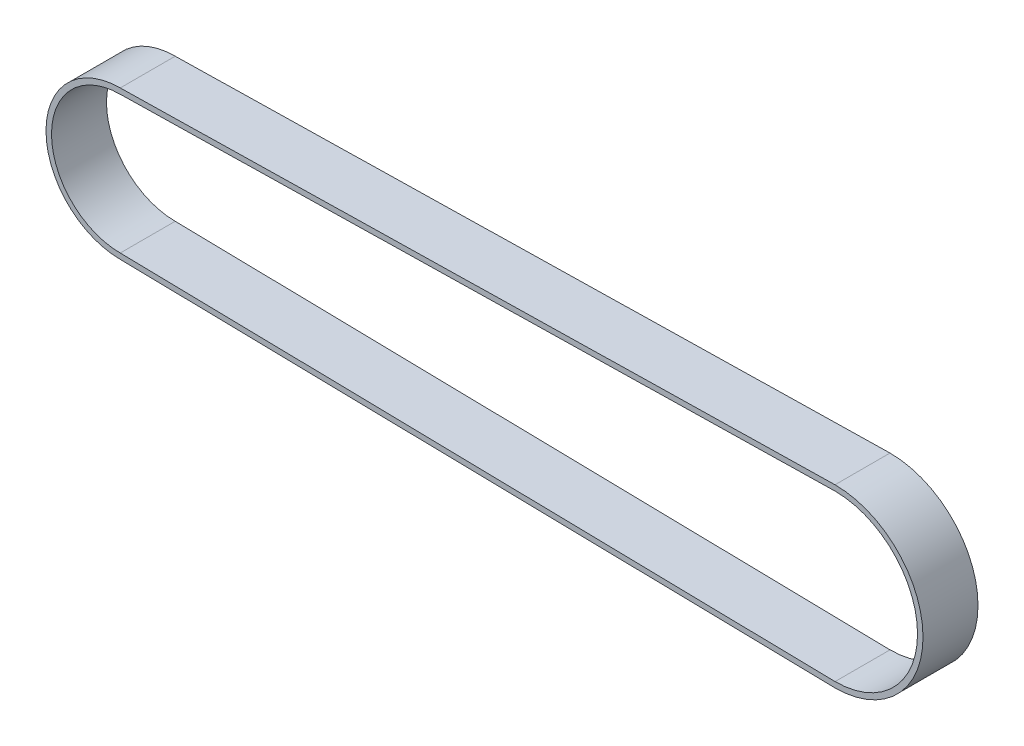
ISO-10303-21;
HEADER;
FILE_DESCRIPTION(('STEP AP214'),'2;1');
FILE_NAME('part.step','',(''),(''),'','','');
FILE_SCHEMA(('AUTOMOTIVE_DESIGN { 1 0 10303 214 1 1 1 1 }'));
ENDSEC;
DATA;
#1=APPLICATION_CONTEXT('core data for automotive mechanical design processes');
#2=APPLICATION_PROTOCOL_DEFINITION('international standard','automotive_design',2000,#1);
#3=PRODUCT_CONTEXT('',#1,'mechanical');
#4=PRODUCT('Part','Part','',(#3));
#5=PRODUCT_RELATED_PRODUCT_CATEGORY('part','',(#4));
#6=PRODUCT_DEFINITION_FORMATION('','',#4);
#7=PRODUCT_DEFINITION_CONTEXT('part definition',#1,'design');
#8=PRODUCT_DEFINITION('design','',#6,#7);
#9=PRODUCT_DEFINITION_SHAPE('','',#8);
#10=(LENGTH_UNIT() NAMED_UNIT(*) SI_UNIT(.MILLI.,.METRE.));
#11=(NAMED_UNIT(*) PLANE_ANGLE_UNIT() SI_UNIT($,.RADIAN.));
#12=(NAMED_UNIT(*) SI_UNIT($,.STERADIAN.) SOLID_ANGLE_UNIT());
#13=UNCERTAINTY_MEASURE_WITH_UNIT(LENGTH_MEASURE(1.E-05),#10,'distance_accuracy_value','');
#14=(GEOMETRIC_REPRESENTATION_CONTEXT(3) GLOBAL_UNCERTAINTY_ASSIGNED_CONTEXT((#13)) GLOBAL_UNIT_ASSIGNED_CONTEXT((#10,
#11,#12)) REPRESENTATION_CONTEXT('',''));
#15=CARTESIAN_POINT('',(0.,0.,0.));
#16=DIRECTION('',(0.,0.,1.));
#17=DIRECTION('',(1.,0.,0.));
#18=AXIS2_PLACEMENT_3D('',#15,#16,#17);
#19=CARTESIAN_POINT('',(-0.2202138454263,11.4511199621676,10.));
#20=DIRECTION('',(-0.0192272142313432,0.999815140029847,0.));
#21=DIRECTION('',(-0.999815140029847,-0.0192272142313432,0.));
#22=AXIS2_PLACEMENT_3D('',#19,#20,#21);
#23=PLANE('',#22);
#24=DIRECTION('',(0.999815140029847,0.0192272142313432,0.));
#25=VECTOR('',#24,1.);
#26=CARTESIAN_POINT('',(-0.2202138454263,11.4511199621676,0.));
#27=LINE('',#26,#25);
#28=CARTESIAN_POINT('',(-63.3751394755015,10.2366021615892,0.));
#29=VERTEX_POINT('',#28);
#30=CARTESIAN_POINT('',(66.6248605244986,12.7366021615892,0.));
#31=VERTEX_POINT('',#30);
#32=EDGE_CURVE('E140',#29,#31,#27,.T.);
#33=ORIENTED_EDGE('',*,*,#32,.T.);
#34=DIRECTION('',(0.,0.,-1.));
#35=VECTOR('',#34,1.);
#36=CARTESIAN_POINT('',(66.6248605244986,12.7366021615892,10.));
#37=LINE('',#36,#35);
#38=CARTESIAN_POINT('',(66.6248605244986,12.7366021615892,10.));
#39=VERTEX_POINT('',#38);
#40=EDGE_CURVE('E11',#39,#31,#37,.T.);
#41=ORIENTED_EDGE('',*,*,#40,.F.);
#42=DIRECTION('',(0.999815140029847,0.0192272142313432,0.));
#43=VECTOR('',#42,1.);
#44=CARTESIAN_POINT('',(-0.2202138454263,11.4511199621676,10.));
#45=LINE('',#44,#43);
#46=CARTESIAN_POINT('',(-63.3751394755015,10.2366021615892,10.));
#47=VERTEX_POINT('',#46);
#48=EDGE_CURVE('E114',#47,#39,#45,.T.);
#49=ORIENTED_EDGE('',*,*,#48,.F.);
#50=DIRECTION('',(0.,0.,-1.));
#51=VECTOR('',#50,1.);
#52=CARTESIAN_POINT('',(-63.3751394755015,10.2366021615892,10.));
#53=LINE('',#52,#51);
#54=EDGE_CURVE('E147',#47,#29,#53,.T.);
#55=ORIENTED_EDGE('',*,*,#54,.T.);
#56=EDGE_LOOP('',(#33,#41,#49,#55));
#57=FACE_BOUND('',#56,.T.);
#58=ADVANCED_FACE('F33',(#57),#23,.F.);
#59=CARTESIAN_POINT('',(66.6248605244986,-2.26339783841076,10.));
#60=DIRECTION('',(0.,0.,-1.));
#61=DIRECTION('',(-1.,0.,0.));
#62=AXIS2_PLACEMENT_3D('',#59,#60,#61);
#63=CYLINDRICAL_SURFACE('',#62,15.);
#64=CARTESIAN_POINT('',(66.6248605244986,-2.26339783841076,0.));
#65=DIRECTION('',(0.,0.,1.));
#66=DIRECTION('',(1.,0.,0.));
#67=AXIS2_PLACEMENT_3D('',#64,#65,#66);
#68=CIRCLE('',#67,15.);
#69=CARTESIAN_POINT('',(66.6248605244986,-17.2633978384108,0.));
#70=VERTEX_POINT('',#69);
#71=EDGE_CURVE('E119',#31,#70,#68,.F.);
#72=ORIENTED_EDGE('',*,*,#71,.T.);
#73=DIRECTION('',(0.,0.,-1.));
#74=VECTOR('',#73,1.);
#75=CARTESIAN_POINT('',(66.6248605244986,-17.2633978384108,10.));
#76=LINE('',#75,#74);
#77=CARTESIAN_POINT('',(66.6248605244986,-17.2633978384108,10.));
#78=VERTEX_POINT('',#77);
#79=EDGE_CURVE('E43',#78,#70,#76,.T.);
#80=ORIENTED_EDGE('',*,*,#79,.F.);
#81=CARTESIAN_POINT('',(66.6248605244986,-2.26339783841076,10.));
#82=DIRECTION('',(0.,0.,1.));
#83=DIRECTION('',(1.,0.,0.));
#84=AXIS2_PLACEMENT_3D('',#81,#82,#83);
#85=CIRCLE('',#84,15.);
#86=EDGE_CURVE('E108',#39,#78,#85,.F.);
#87=ORIENTED_EDGE('',*,*,#86,.F.);
#88=ORIENTED_EDGE('',*,*,#40,.T.);
#89=EDGE_LOOP('',(#72,#80,#87,#88));
#90=FACE_BOUND('',#89,.T.);
#91=ADVANCED_FACE('F118',(#90),#63,.F.);
#92=CARTESIAN_POINT('',(-0.307235425904939,-15.9762421470568,10.));
#93=DIRECTION('',(-0.0192272142313432,-0.999815140029847,0.));
#94=DIRECTION('',(0.999815140029847,-0.0192272142313432,0.));
#95=AXIS2_PLACEMENT_3D('',#92,#93,#94);
#96=PLANE('',#95);
#97=DIRECTION('',(-0.999815140029847,0.0192272142313432,0.));
#98=VECTOR('',#97,1.);
#99=CARTESIAN_POINT('',(-0.307235425904939,-15.9762421470568,0.));
#100=LINE('',#99,#98);
#101=CARTESIAN_POINT('',(-63.3751394755014,-14.7633978384108,0.));
#102=VERTEX_POINT('',#101);
#103=EDGE_CURVE('E81',#70,#102,#100,.T.);
#104=ORIENTED_EDGE('',*,*,#103,.T.);
#105=DIRECTION('',(0.,0.,-1.));
#106=VECTOR('',#105,1.);
#107=CARTESIAN_POINT('',(-63.3751394755014,-14.7633978384108,10.));
#108=LINE('',#107,#106);
#109=CARTESIAN_POINT('',(-63.3751394755014,-14.7633978384108,10.));
#110=VERTEX_POINT('',#109);
#111=EDGE_CURVE('E120',#110,#102,#108,.T.);
#112=ORIENTED_EDGE('',*,*,#111,.F.);
#113=DIRECTION('',(-0.999815140029847,0.0192272142313432,0.));
#114=VECTOR('',#113,1.);
#115=CARTESIAN_POINT('',(-0.307235425904939,-15.9762421470568,10.));
#116=LINE('',#115,#114);
#117=EDGE_CURVE('E112',#78,#110,#116,.T.);
#118=ORIENTED_EDGE('',*,*,#117,.F.);
#119=ORIENTED_EDGE('',*,*,#79,.T.);
#120=EDGE_LOOP('',(#104,#112,#118,#119));
#121=FACE_BOUND('',#120,.T.);
#122=ADVANCED_FACE('F122',(#121),#96,.F.);
#123=CARTESIAN_POINT('',(66.6248605244986,-2.26339783841076,10.));
#124=DIRECTION('',(0.,0.,-1.));
#125=DIRECTION('',(-1.,0.,0.));
#126=AXIS2_PLACEMENT_3D('',#123,#124,#125);
#127=CYLINDRICAL_SURFACE('',#126,16.);
#128=CARTESIAN_POINT('',(66.6248605244986,-2.26339783841076,0.));
#129=DIRECTION('',(0.,0.,1.));
#130=DIRECTION('',(1.,0.,0.));
#131=AXIS2_PLACEMENT_3D('',#128,#129,#130);
#132=CIRCLE('',#131,16.);
#133=CARTESIAN_POINT('',(66.6248605244986,13.7366021615892,0.));
#134=VERTEX_POINT('',#133);
#135=CARTESIAN_POINT('',(66.6248605244986,-18.2633978384108,0.));
#136=VERTEX_POINT('',#135);
#137=EDGE_CURVE('E128',#134,#136,#132,.F.);
#138=ORIENTED_EDGE('',*,*,#137,.F.);
#139=DIRECTION('',(0.,0.,-1.));
#140=VECTOR('',#139,1.);
#141=CARTESIAN_POINT('',(66.6248605244986,13.7366021615892,10.));
#142=LINE('',#141,#140);
#143=CARTESIAN_POINT('',(66.6248605244986,13.7366021615892,10.));
#144=VERTEX_POINT('',#143);
#145=EDGE_CURVE('E37',#144,#134,#142,.T.);
#146=ORIENTED_EDGE('',*,*,#145,.F.);
#147=CARTESIAN_POINT('',(66.6248605244986,-2.26339783841076,10.));
#148=DIRECTION('',(0.,0.,1.));
#149=DIRECTION('',(1.,0.,0.));
#150=AXIS2_PLACEMENT_3D('',#147,#148,#149);
#151=CIRCLE('',#150,16.);
#152=CARTESIAN_POINT('',(66.6248605244986,-18.2633978384108,10.));
#153=VERTEX_POINT('',#152);
#154=EDGE_CURVE('E146',#144,#153,#151,.F.);
#155=ORIENTED_EDGE('',*,*,#154,.T.);
#156=DIRECTION('',(0.,0.,-1.));
#157=VECTOR('',#156,1.);
#158=CARTESIAN_POINT('',(66.6248605244986,-18.2633978384108,10.));
#159=LINE('',#158,#157);
#160=EDGE_CURVE('E124',#153,#136,#159,.T.);
#161=ORIENTED_EDGE('',*,*,#160,.T.);
#162=EDGE_LOOP('',(#138,#146,#155,#161));
#163=FACE_BOUND('',#162,.T.);
#164=ADVANCED_FACE('F35',(#163),#127,.T.);
#165=CARTESIAN_POINT('',(-0.239437505315394,12.4507502764005,10.));
#166=DIRECTION('',(-0.0192272142313432,0.999815140029847,0.));
#167=DIRECTION('',(-0.999815140029847,-0.0192272142313432,0.));
#168=AXIS2_PLACEMENT_3D('',#165,#166,#167);
#169=PLANE('',#168);
#170=DIRECTION('',(0.999815140029847,0.0192272142313432,0.));
#171=VECTOR('',#170,1.);
#172=CARTESIAN_POINT('',(-0.239437505315394,12.4507502764005,0.));
#173=LINE('',#172,#171);
#174=CARTESIAN_POINT('',(-63.3751394755015,11.2366021615892,0.));
#175=VERTEX_POINT('',#174);
#176=EDGE_CURVE('E131',#175,#134,#173,.T.);
#177=ORIENTED_EDGE('',*,*,#176,.F.);
#178=DIRECTION('',(0.,0.,-1.));
#179=VECTOR('',#178,1.);
#180=CARTESIAN_POINT('',(-63.3751394755015,11.2366021615892,10.));
#181=LINE('',#180,#179);
#182=CARTESIAN_POINT('',(-63.3751394755015,11.2366021615892,10.));
#183=VERTEX_POINT('',#182);
#184=EDGE_CURVE('E152',#183,#175,#181,.T.);
#185=ORIENTED_EDGE('',*,*,#184,.F.);
#186=DIRECTION('',(0.999815140029847,0.0192272142313432,0.));
#187=VECTOR('',#186,1.);
#188=CARTESIAN_POINT('',(-0.239437505315394,12.4507502764005,10.));
#189=LINE('',#188,#187);
#190=EDGE_CURVE('E161',#183,#144,#189,.T.);
#191=ORIENTED_EDGE('',*,*,#190,.T.);
#192=ORIENTED_EDGE('',*,*,#145,.T.);
#193=EDGE_LOOP('',(#177,#185,#191,#192));
#194=FACE_BOUND('',#193,.T.);
#195=ADVANCED_FACE('F159',(#194),#169,.T.);
#196=CARTESIAN_POINT('',(-63.3751394755014,-2.26339783841076,10.));
#197=DIRECTION('',(0.,0.,-1.));
#198=DIRECTION('',(-1.,0.,0.));
#199=AXIS2_PLACEMENT_3D('',#196,#197,#198);
#200=CYLINDRICAL_SURFACE('',#199,13.5);
#201=CARTESIAN_POINT('',(-63.3751394755014,-2.26339783841076,0.));
#202=DIRECTION('',(0.,0.,1.));
#203=DIRECTION('',(1.,0.,0.));
#204=AXIS2_PLACEMENT_3D('',#201,#202,#203);
#205=CIRCLE('',#204,13.5);
#206=CARTESIAN_POINT('',(-63.3751394755014,-15.7633978384108,0.));
#207=VERTEX_POINT('',#206);
#208=EDGE_CURVE('E134',#175,#207,#205,.T.);
#209=ORIENTED_EDGE('',*,*,#208,.T.);
#210=DIRECTION('',(0.,0.,-1.));
#211=VECTOR('',#210,1.);
#212=CARTESIAN_POINT('',(-63.3751394755014,-15.7633978384108,10.));
#213=LINE('',#212,#211);
#214=CARTESIAN_POINT('',(-63.3751394755014,-15.7633978384108,10.));
#215=VERTEX_POINT('',#214);
#216=EDGE_CURVE('E151',#215,#207,#213,.T.);
#217=ORIENTED_EDGE('',*,*,#216,.F.);
#218=CARTESIAN_POINT('',(-63.3751394755014,-2.26339783841076,10.));
#219=DIRECTION('',(0.,0.,1.));
#220=DIRECTION('',(1.,0.,0.));
#221=AXIS2_PLACEMENT_3D('',#218,#219,#220);
#222=CIRCLE('',#221,13.5);
#223=EDGE_CURVE('E169',#183,#215,#222,.T.);
#224=ORIENTED_EDGE('',*,*,#223,.F.);
#225=ORIENTED_EDGE('',*,*,#184,.T.);
#226=EDGE_LOOP('',(#209,#217,#224,#225));
#227=FACE_BOUND('',#226,.T.);
#228=ADVANCED_FACE('F167',(#227),#200,.T.);
#229=CARTESIAN_POINT('',(-0.326459085794033,-16.9758724612897,10.));
#230=DIRECTION('',(-0.0192272142313432,-0.999815140029847,0.));
#231=DIRECTION('',(0.999815140029847,-0.0192272142313432,0.));
#232=AXIS2_PLACEMENT_3D('',#229,#230,#231);
#233=PLANE('',#232);
#234=DIRECTION('',(-0.999815140029847,0.0192272142313432,0.));
#235=VECTOR('',#234,1.);
#236=CARTESIAN_POINT('',(-0.326459085794033,-16.9758724612897,0.));
#237=LINE('',#236,#235);
#238=EDGE_CURVE('E137',#136,#207,#237,.T.);
#239=ORIENTED_EDGE('',*,*,#238,.F.);
#240=ORIENTED_EDGE('',*,*,#160,.F.);
#241=DIRECTION('',(-0.999815140029847,0.0192272142313432,0.));
#242=VECTOR('',#241,1.);
#243=CARTESIAN_POINT('',(-0.326459085794033,-16.9758724612897,10.));
#244=LINE('',#243,#242);
#245=EDGE_CURVE('E172',#153,#215,#244,.T.);
#246=ORIENTED_EDGE('',*,*,#245,.T.);
#247=ORIENTED_EDGE('',*,*,#216,.T.);
#248=EDGE_LOOP('',(#239,#240,#246,#247));
#249=FACE_BOUND('',#248,.T.);
#250=ADVANCED_FACE('F173',(#249),#233,.T.);
#251=CARTESIAN_POINT('',(-63.3751394755014,-2.26339783841076,10.));
#252=DIRECTION('',(0.,0.,-1.));
#253=DIRECTION('',(-1.,0.,0.));
#254=AXIS2_PLACEMENT_3D('',#251,#252,#253);
#255=CYLINDRICAL_SURFACE('',#254,12.5);
#256=CARTESIAN_POINT('',(-63.3751394755014,-2.26339783841076,0.));
#257=DIRECTION('',(0.,0.,1.));
#258=DIRECTION('',(1.,0.,0.));
#259=AXIS2_PLACEMENT_3D('',#256,#257,#258);
#260=CIRCLE('',#259,12.5);
#261=EDGE_CURVE('E87',#102,#29,#260,.F.);
#262=ORIENTED_EDGE('',*,*,#261,.T.);
#263=ORIENTED_EDGE('',*,*,#54,.F.);
#264=CARTESIAN_POINT('',(-63.3751394755014,-2.26339783841076,10.));
#265=DIRECTION('',(0.,0.,1.));
#266=DIRECTION('',(1.,0.,0.));
#267=AXIS2_PLACEMENT_3D('',#264,#265,#266);
#268=CIRCLE('',#267,12.5);
#269=EDGE_CURVE('E52',#110,#47,#268,.F.);
#270=ORIENTED_EDGE('',*,*,#269,.F.);
#271=ORIENTED_EDGE('',*,*,#111,.T.);
#272=EDGE_LOOP('',(#262,#263,#270,#271));
#273=FACE_BOUND('',#272,.T.);
#274=ADVANCED_FACE('F180',(#273),#255,.F.);
#275=CARTESIAN_POINT('',(0.,0.,10.));
#276=DIRECTION('',(0.,0.,1.));
#277=DIRECTION('',(1.,0.,0.));
#278=AXIS2_PLACEMENT_3D('',#275,#276,#277);
#279=PLANE('',#278);
#280=ORIENTED_EDGE('',*,*,#154,.F.);
#281=ORIENTED_EDGE('',*,*,#190,.F.);
#282=ORIENTED_EDGE('',*,*,#223,.T.);
#283=ORIENTED_EDGE('',*,*,#245,.F.);
#284=EDGE_LOOP('',(#280,#281,#282,#283));
#285=FACE_BOUND('',#284,.T.);
#286=ORIENTED_EDGE('',*,*,#48,.T.);
#287=ORIENTED_EDGE('',*,*,#86,.T.);
#288=ORIENTED_EDGE('',*,*,#117,.T.);
#289=ORIENTED_EDGE('',*,*,#269,.T.);
#290=EDGE_LOOP('',(#286,#287,#288,#289));
#291=FACE_BOUND('',#290,.T.);
#292=ADVANCED_FACE('F110',(#285,#291),#279,.T.);
#293=CARTESIAN_POINT('',(0.,0.,0.));
#294=DIRECTION('',(0.,0.,1.));
#295=DIRECTION('',(1.,0.,0.));
#296=AXIS2_PLACEMENT_3D('',#293,#294,#295);
#297=PLANE('',#296);
#298=ORIENTED_EDGE('',*,*,#137,.T.);
#299=ORIENTED_EDGE('',*,*,#238,.T.);
#300=ORIENTED_EDGE('',*,*,#208,.F.);
#301=ORIENTED_EDGE('',*,*,#176,.T.);
#302=EDGE_LOOP('',(#298,#299,#300,#301));
#303=FACE_BOUND('',#302,.T.);
#304=ORIENTED_EDGE('',*,*,#32,.F.);
#305=ORIENTED_EDGE('',*,*,#261,.F.);
#306=ORIENTED_EDGE('',*,*,#103,.F.);
#307=ORIENTED_EDGE('',*,*,#71,.F.);
#308=EDGE_LOOP('',(#304,#305,#306,#307));
#309=FACE_BOUND('',#308,.T.);
#310=ADVANCED_FACE('F164',(#303,#309),#297,.F.);
#311=CLOSED_SHELL('',(#58,#91,#122,#164,#195,#228,#250,#274,#292,#310));
#312=MANIFOLD_SOLID_BREP('B2',#311);
#313=ADVANCED_BREP_SHAPE_REPRESENTATION('',(#18,#312),#14);
#314=SHAPE_DEFINITION_REPRESENTATION(#9,#313);
ENDSEC;
END-ISO-10303-21;
